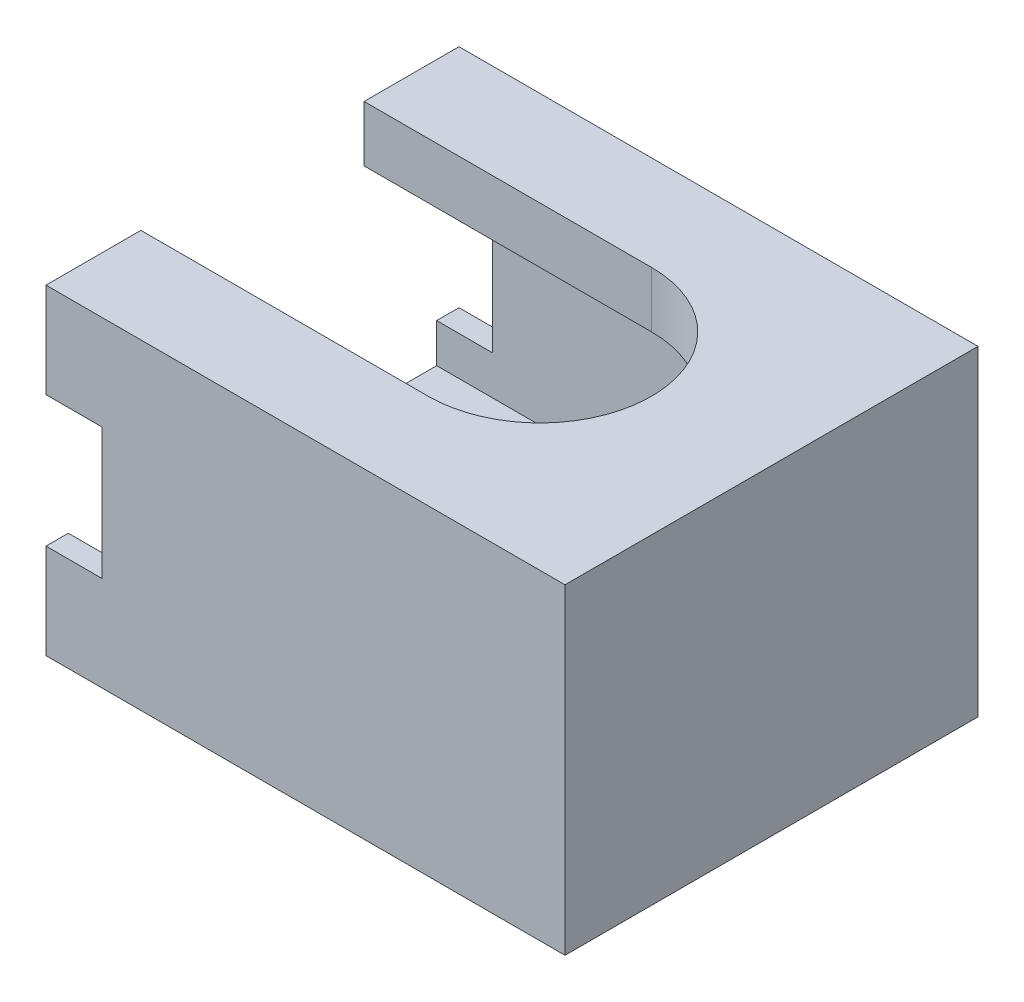
ISO-10303-21;
HEADER;
FILE_DESCRIPTION(('STEP AP214'),'2;1');
FILE_NAME('part.step','',(''),(''),'','','');
FILE_SCHEMA(('AUTOMOTIVE_DESIGN { 1 0 10303 214 1 1 1 1 }'));
ENDSEC;
DATA;
#1=APPLICATION_CONTEXT('core data for automotive mechanical design processes');
#2=APPLICATION_PROTOCOL_DEFINITION('international standard','automotive_design',2000,#1);
#3=PRODUCT_CONTEXT('',#1,'mechanical');
#4=PRODUCT('Part','Part','',(#3));
#5=PRODUCT_RELATED_PRODUCT_CATEGORY('part','',(#4));
#6=PRODUCT_DEFINITION_FORMATION('','',#4);
#7=PRODUCT_DEFINITION_CONTEXT('part definition',#1,'design');
#8=PRODUCT_DEFINITION('design','',#6,#7);
#9=PRODUCT_DEFINITION_SHAPE('','',#8);
#10=(LENGTH_UNIT() NAMED_UNIT(*) SI_UNIT(.MILLI.,.METRE.));
#11=(NAMED_UNIT(*) PLANE_ANGLE_UNIT() SI_UNIT($,.RADIAN.));
#12=(NAMED_UNIT(*) SI_UNIT($,.STERADIAN.) SOLID_ANGLE_UNIT());
#13=UNCERTAINTY_MEASURE_WITH_UNIT(LENGTH_MEASURE(1.E-05),#10,'distance_accuracy_value','');
#14=(GEOMETRIC_REPRESENTATION_CONTEXT(3) GLOBAL_UNCERTAINTY_ASSIGNED_CONTEXT((#13)) GLOBAL_UNIT_ASSIGNED_CONTEXT((#10,
#11,#12)) REPRESENTATION_CONTEXT('',''));
#15=CARTESIAN_POINT('',(0.,0.,0.));
#16=DIRECTION('',(0.,0.,1.));
#17=DIRECTION('',(1.,0.,0.));
#18=AXIS2_PLACEMENT_3D('',#15,#16,#17);
#19=CARTESIAN_POINT('',(-8.3,7.5,-7.4));
#20=DIRECTION('',(1.,0.,0.));
#21=DIRECTION('',(0.,0.,-1.));
#22=AXIS2_PLACEMENT_3D('',#19,#20,#21);
#23=PLANE('',#22);
#24=DIRECTION('',(0.,1.,0.));
#25=VECTOR('',#24,1.);
#26=CARTESIAN_POINT('',(-8.3,0.,-4.));
#27=LINE('',#26,#25);
#28=CARTESIAN_POINT('',(-8.3,-2.,-4.));
#29=VERTEX_POINT('',#28);
#30=CARTESIAN_POINT('',(-8.3,0.,-4.));
#31=VERTEX_POINT('',#30);
#32=EDGE_CURVE('E235',#29,#31,#27,.T.);
#33=ORIENTED_EDGE('',*,*,#32,.F.);
#34=DIRECTION('',(0.,0.,-1.));
#35=VECTOR('',#34,1.);
#36=CARTESIAN_POINT('',(-8.3,-2.,-7.4));
#37=LINE('',#36,#35);
#38=CARTESIAN_POINT('',(-8.3,-2.,4.));
#39=VERTEX_POINT('',#38);
#40=EDGE_CURVE('E216',#39,#29,#37,.T.);
#41=ORIENTED_EDGE('',*,*,#40,.F.);
#42=DIRECTION('',(0.,-1.,0.));
#43=VECTOR('',#42,1.);
#44=CARTESIAN_POINT('',(-8.3,-2.,4.));
#45=LINE('',#44,#43);
#46=CARTESIAN_POINT('',(-8.3,0.,4.));
#47=VERTEX_POINT('',#46);
#48=EDGE_CURVE('E263',#47,#39,#45,.T.);
#49=ORIENTED_EDGE('',*,*,#48,.F.);
#50=DIRECTION('',(0.,0.,-1.));
#51=VECTOR('',#50,1.);
#52=CARTESIAN_POINT('',(-8.3,0.,-7.4));
#53=LINE('',#52,#51);
#54=EDGE_CURVE('E404',#47,#31,#53,.T.);
#55=ORIENTED_EDGE('',*,*,#54,.T.);
#56=EDGE_LOOP('',(#33,#41,#49,#55));
#57=FACE_BOUND('',#56,.T.);
#58=ADVANCED_FACE('F39',(#57),#23,.F.);
#59=DIRECTION('',(0.,0.,-1.));
#60=VECTOR('',#59,1.);
#61=CARTESIAN_POINT('',(-8.3,1.4,-7.4));
#62=LINE('',#61,#60);
#63=CARTESIAN_POINT('',(-8.3,1.4,-6.6));
#64=VERTEX_POINT('',#63);
#65=CARTESIAN_POINT('',(-8.3,1.4,-7.4));
#66=VERTEX_POINT('',#65);
#67=EDGE_CURVE('E232',#64,#66,#62,.T.);
#68=ORIENTED_EDGE('',*,*,#67,.F.);
#69=DIRECTION('',(0.,-1.,0.));
#70=VECTOR('',#69,1.);
#71=CARTESIAN_POINT('',(-8.3,7.5,-6.6));
#72=LINE('',#71,#70);
#73=CARTESIAN_POINT('',(-8.3,6.1,-6.6));
#74=VERTEX_POINT('',#73);
#75=EDGE_CURVE('E428',#74,#64,#72,.T.);
#76=ORIENTED_EDGE('',*,*,#75,.F.);
#77=DIRECTION('',(0.,0.,1.));
#78=VECTOR('',#77,1.);
#79=CARTESIAN_POINT('',(-8.3,6.1,-7.4));
#80=LINE('',#79,#78);
#81=CARTESIAN_POINT('',(-8.3,6.1,-7.4));
#82=VERTEX_POINT('',#81);
#83=EDGE_CURVE('E333',#82,#74,#80,.T.);
#84=ORIENTED_EDGE('',*,*,#83,.F.);
#85=DIRECTION('',(0.,-1.,0.));
#86=VECTOR('',#85,1.);
#87=CARTESIAN_POINT('',(-8.3,7.5,-7.4));
#88=LINE('',#87,#86);
#89=EDGE_CURVE('E441',#82,#66,#88,.T.);
#90=ORIENTED_EDGE('',*,*,#89,.T.);
#91=EDGE_LOOP('',(#68,#76,#84,#90));
#92=FACE_BOUND('',#91,.T.);
#93=ADVANCED_FACE('F522',(#92),#23,.F.);
#94=DIRECTION('',(0.,0.,-1.));
#95=VECTOR('',#94,1.);
#96=CARTESIAN_POINT('',(-8.3,1.4,6.6));
#97=LINE('',#96,#95);
#98=CARTESIAN_POINT('',(-8.3,1.4,7.4));
#99=VERTEX_POINT('',#98);
#100=CARTESIAN_POINT('',(-8.3,1.4,6.6));
#101=VERTEX_POINT('',#100);
#102=EDGE_CURVE('E269',#99,#101,#97,.T.);
#103=ORIENTED_EDGE('',*,*,#102,.F.);
#104=DIRECTION('',(0.,-1.,0.));
#105=VECTOR('',#104,1.);
#106=CARTESIAN_POINT('',(-8.3,7.5,7.4));
#107=LINE('',#106,#105);
#108=CARTESIAN_POINT('',(-8.3,6.1,7.4));
#109=VERTEX_POINT('',#108);
#110=EDGE_CURVE('E450',#109,#99,#107,.T.);
#111=ORIENTED_EDGE('',*,*,#110,.F.);
#112=DIRECTION('',(0.,0.,1.));
#113=VECTOR('',#112,1.);
#114=CARTESIAN_POINT('',(-8.3,6.1,6.6));
#115=LINE('',#114,#113);
#116=CARTESIAN_POINT('',(-8.3,6.1,6.6));
#117=VERTEX_POINT('',#116);
#118=EDGE_CURVE('E63',#117,#109,#115,.T.);
#119=ORIENTED_EDGE('',*,*,#118,.F.);
#120=DIRECTION('',(0.,-1.,0.));
#121=VECTOR('',#120,1.);
#122=CARTESIAN_POINT('',(-8.3,7.5,6.6));
#123=LINE('',#122,#121);
#124=EDGE_CURVE('E454',#117,#101,#123,.T.);
#125=ORIENTED_EDGE('',*,*,#124,.T.);
#126=EDGE_LOOP('',(#103,#111,#119,#125));
#127=FACE_BOUND('',#126,.T.);
#128=ADVANCED_FACE('F491',(#127),#23,.F.);
#129=CARTESIAN_POINT('',(7.5,7.5,-6.6));
#130=DIRECTION('',(0.,0.,-1.));
#131=DIRECTION('',(-1.,0.,0.));
#132=AXIS2_PLACEMENT_3D('',#129,#130,#131);
#133=PLANE('',#132);
#134=DIRECTION('',(1.,0.,0.));
#135=VECTOR('',#134,1.);
#136=CARTESIAN_POINT('',(7.5,0.,-6.6));
#137=LINE('',#136,#135);
#138=CARTESIAN_POINT('',(-10.3,0.,-6.6));
#139=VERTEX_POINT('',#138);
#140=CARTESIAN_POINT('',(7.5,0.,-6.6));
#141=VERTEX_POINT('',#140);
#142=EDGE_CURVE('E215',#139,#141,#137,.T.);
#143=ORIENTED_EDGE('',*,*,#142,.T.);
#144=DIRECTION('',(0.,-1.,0.));
#145=VECTOR('',#144,1.);
#146=CARTESIAN_POINT('',(7.5,7.5,-6.6));
#147=LINE('',#146,#145);
#148=CARTESIAN_POINT('',(7.5,7.5,-6.6));
#149=VERTEX_POINT('',#148);
#150=EDGE_CURVE('E11',#149,#141,#147,.T.);
#151=ORIENTED_EDGE('',*,*,#150,.F.);
#152=DIRECTION('',(1.,0.,0.));
#153=VECTOR('',#152,1.);
#154=CARTESIAN_POINT('',(-8.3,7.5,-6.6));
#155=LINE('',#154,#153);
#156=CARTESIAN_POINT('',(-10.3,7.5,-6.6));
#157=VERTEX_POINT('',#156);
#158=EDGE_CURVE('E416',#157,#149,#155,.T.);
#159=ORIENTED_EDGE('',*,*,#158,.F.);
#160=DIRECTION('',(0.,1.,0.));
#161=VECTOR('',#160,1.);
#162=CARTESIAN_POINT('',(-10.3,6.1,-6.6));
#163=LINE('',#162,#161);
#164=CARTESIAN_POINT('',(-10.3,6.1,-6.6));
#165=VERTEX_POINT('',#164);
#166=EDGE_CURVE('E348',#165,#157,#163,.T.);
#167=ORIENTED_EDGE('',*,*,#166,.F.);
#168=DIRECTION('',(1.,0.,0.));
#169=VECTOR('',#168,1.);
#170=CARTESIAN_POINT('',(-10.3,6.1,-6.6));
#171=LINE('',#170,#169);
#172=EDGE_CURVE('E356',#165,#74,#171,.T.);
#173=ORIENTED_EDGE('',*,*,#172,.T.);
#174=ORIENTED_EDGE('',*,*,#75,.T.);
#175=DIRECTION('',(1.,0.,0.));
#176=VECTOR('',#175,1.);
#177=CARTESIAN_POINT('',(-10.3,1.4,-6.6));
#178=LINE('',#177,#176);
#179=CARTESIAN_POINT('',(-10.3,1.4,-6.6));
#180=VERTEX_POINT('',#179);
#181=EDGE_CURVE('E254',#180,#64,#178,.T.);
#182=ORIENTED_EDGE('',*,*,#181,.F.);
#183=DIRECTION('',(0.,1.,0.));
#184=VECTOR('',#183,1.);
#185=CARTESIAN_POINT('',(-10.3,1.4,-6.6));
#186=LINE('',#185,#184);
#187=EDGE_CURVE('E244',#139,#180,#186,.T.);
#188=ORIENTED_EDGE('',*,*,#187,.F.);
#189=EDGE_LOOP('',(#143,#151,#159,#167,#173,#174,#182,#188));
#190=FACE_BOUND('',#189,.T.);
#191=ADVANCED_FACE('F41',(#190),#133,.F.);
#192=CARTESIAN_POINT('',(7.5,7.5,6.6));
#193=DIRECTION('',(1.,0.,0.));
#194=DIRECTION('',(0.,0.,-1.));
#195=AXIS2_PLACEMENT_3D('',#192,#193,#194);
#196=PLANE('',#195);
#197=DIRECTION('',(0.,0.,1.));
#198=VECTOR('',#197,1.);
#199=CARTESIAN_POINT('',(7.5,0.,6.6));
#200=LINE('',#199,#198);
#201=CARTESIAN_POINT('',(7.5,0.,6.6));
#202=VERTEX_POINT('',#201);
#203=EDGE_CURVE('E432',#141,#202,#200,.T.);
#204=ORIENTED_EDGE('',*,*,#203,.T.);
#205=DIRECTION('',(0.,-1.,0.));
#206=VECTOR('',#205,1.);
#207=CARTESIAN_POINT('',(7.5,7.5,6.6));
#208=LINE('',#207,#206);
#209=CARTESIAN_POINT('',(7.5,7.5,6.6));
#210=VERTEX_POINT('',#209);
#211=EDGE_CURVE('E48',#210,#202,#208,.T.);
#212=ORIENTED_EDGE('',*,*,#211,.F.);
#213=DIRECTION('',(0.,0.,1.));
#214=VECTOR('',#213,1.);
#215=CARTESIAN_POINT('',(7.5,7.5,6.6));
#216=LINE('',#215,#214);
#217=EDGE_CURVE('E420',#149,#210,#216,.T.);
#218=ORIENTED_EDGE('',*,*,#217,.F.);
#219=ORIENTED_EDGE('',*,*,#150,.T.);
#220=EDGE_LOOP('',(#204,#212,#218,#219));
#221=FACE_BOUND('',#220,.T.);
#222=ADVANCED_FACE('F466',(#221),#196,.F.);
#223=CARTESIAN_POINT('',(-7.5,7.5,6.6));
#224=DIRECTION('',(0.,0.,1.));
#225=DIRECTION('',(1.,0.,0.));
#226=AXIS2_PLACEMENT_3D('',#223,#224,#225);
#227=PLANE('',#226);
#228=DIRECTION('',(-1.,0.,0.));
#229=VECTOR('',#228,1.);
#230=CARTESIAN_POINT('',(-7.5,0.,6.6));
#231=LINE('',#230,#229);
#232=CARTESIAN_POINT('',(-10.3,0.,6.6));
#233=VERTEX_POINT('',#232);
#234=EDGE_CURVE('E421',#202,#233,#231,.T.);
#235=ORIENTED_EDGE('',*,*,#234,.T.);
#236=DIRECTION('',(0.,-1.,0.));
#237=VECTOR('',#236,1.);
#238=CARTESIAN_POINT('',(-10.3,0.,6.6));
#239=LINE('',#238,#237);
#240=CARTESIAN_POINT('',(-10.3,1.4,6.6));
#241=VERTEX_POINT('',#240);
#242=EDGE_CURVE('E264',#241,#233,#239,.T.);
#243=ORIENTED_EDGE('',*,*,#242,.F.);
#244=DIRECTION('',(1.,0.,0.));
#245=VECTOR('',#244,1.);
#246=CARTESIAN_POINT('',(-10.3,1.4,6.6));
#247=LINE('',#246,#245);
#248=EDGE_CURVE('E285',#241,#101,#247,.T.);
#249=ORIENTED_EDGE('',*,*,#248,.T.);
#250=ORIENTED_EDGE('',*,*,#124,.F.);
#251=DIRECTION('',(1.,0.,0.));
#252=VECTOR('',#251,1.);
#253=CARTESIAN_POINT('',(-10.3,6.1,6.6));
#254=LINE('',#253,#252);
#255=CARTESIAN_POINT('',(-10.3,6.1,6.6));
#256=VERTEX_POINT('',#255);
#257=EDGE_CURVE('E329',#256,#117,#254,.T.);
#258=ORIENTED_EDGE('',*,*,#257,.F.);
#259=DIRECTION('',(0.,-1.,0.));
#260=VECTOR('',#259,1.);
#261=CARTESIAN_POINT('',(-10.3,7.5,6.6));
#262=LINE('',#261,#260);
#263=CARTESIAN_POINT('',(-10.3,7.5,6.6));
#264=VERTEX_POINT('',#263);
#265=EDGE_CURVE('E313',#264,#256,#262,.T.);
#266=ORIENTED_EDGE('',*,*,#265,.F.);
#267=DIRECTION('',(-1.,0.,0.));
#268=VECTOR('',#267,1.);
#269=CARTESIAN_POINT('',(7.5,7.5,6.6));
#270=LINE('',#269,#268);
#271=EDGE_CURVE('E425',#210,#264,#270,.T.);
#272=ORIENTED_EDGE('',*,*,#271,.F.);
#273=ORIENTED_EDGE('',*,*,#211,.T.);
#274=EDGE_LOOP('',(#235,#243,#249,#250,#258,#266,#272,#273));
#275=FACE_BOUND('',#274,.T.);
#276=ADVANCED_FACE('F460',(#275),#227,.F.);
#277=CARTESIAN_POINT('',(8.3,7.5,7.4));
#278=DIRECTION('',(0.,0.,-1.));
#279=DIRECTION('',(-1.,0.,0.));
#280=AXIS2_PLACEMENT_3D('',#277,#278,#279);
#281=PLANE('',#280);
#282=DIRECTION('',(1.,0.,0.));
#283=VECTOR('',#282,1.);
#284=CARTESIAN_POINT('',(8.3,9.5,7.4));
#285=LINE('',#284,#283);
#286=CARTESIAN_POINT('',(-10.3,9.5,7.4));
#287=VERTEX_POINT('',#286);
#288=CARTESIAN_POINT('',(8.3,9.5,7.4));
#289=VERTEX_POINT('',#288);
#290=EDGE_CURVE('E378',#287,#289,#285,.T.);
#291=ORIENTED_EDGE('',*,*,#290,.F.);
#292=DIRECTION('',(0.,1.,0.));
#293=VECTOR('',#292,1.);
#294=CARTESIAN_POINT('',(-10.3,6.1,7.4));
#295=LINE('',#294,#293);
#296=CARTESIAN_POINT('',(-10.3,6.1,7.4));
#297=VERTEX_POINT('',#296);
#298=EDGE_CURVE('E319',#297,#287,#295,.T.);
#299=ORIENTED_EDGE('',*,*,#298,.F.);
#300=DIRECTION('',(1.,0.,0.));
#301=VECTOR('',#300,1.);
#302=CARTESIAN_POINT('',(-10.3,6.1,7.4));
#303=LINE('',#302,#301);
#304=EDGE_CURVE('E323',#297,#109,#303,.T.);
#305=ORIENTED_EDGE('',*,*,#304,.T.);
#306=ORIENTED_EDGE('',*,*,#110,.T.);
#307=DIRECTION('',(1.,0.,0.));
#308=VECTOR('',#307,1.);
#309=CARTESIAN_POINT('',(-10.3,1.4,7.4));
#310=LINE('',#309,#308);
#311=CARTESIAN_POINT('',(-10.3,1.4,7.4));
#312=VERTEX_POINT('',#311);
#313=EDGE_CURVE('E293',#312,#99,#310,.T.);
#314=ORIENTED_EDGE('',*,*,#313,.F.);
#315=DIRECTION('',(0.,1.,0.));
#316=VECTOR('',#315,1.);
#317=CARTESIAN_POINT('',(-10.3,1.4,7.4));
#318=LINE('',#317,#316);
#319=CARTESIAN_POINT('',(-10.3,-2.,7.4));
#320=VERTEX_POINT('',#319);
#321=EDGE_CURVE('E279',#320,#312,#318,.T.);
#322=ORIENTED_EDGE('',*,*,#321,.F.);
#323=DIRECTION('',(-1.,0.,0.));
#324=VECTOR('',#323,1.);
#325=CARTESIAN_POINT('',(-8.3,-2.,7.4));
#326=LINE('',#325,#324);
#327=CARTESIAN_POINT('',(8.3,-2.,7.4));
#328=VERTEX_POINT('',#327);
#329=EDGE_CURVE('E408',#328,#320,#326,.T.);
#330=ORIENTED_EDGE('',*,*,#329,.F.);
#331=DIRECTION('',(0.,-1.,0.));
#332=VECTOR('',#331,1.);
#333=CARTESIAN_POINT('',(8.3,7.5,7.4));
#334=LINE('',#333,#332);
#335=EDGE_CURVE('E447',#289,#328,#334,.T.);
#336=ORIENTED_EDGE('',*,*,#335,.F.);
#337=EDGE_LOOP('',(#291,#299,#305,#306,#314,#322,#330,#336));
#338=FACE_BOUND('',#337,.T.);
#339=ADVANCED_FACE('F494',(#338),#281,.F.);
#340=CARTESIAN_POINT('',(8.3,7.5,7.4));
#341=DIRECTION('',(-1.,0.,0.));
#342=DIRECTION('',(0.,0.,1.));
#343=AXIS2_PLACEMENT_3D('',#340,#341,#342);
#344=PLANE('',#343);
#345=ORIENTED_EDGE('',*,*,#335,.T.);
#346=DIRECTION('',(0.,0.,1.));
#347=VECTOR('',#346,1.);
#348=CARTESIAN_POINT('',(8.3,-2.,-7.4));
#349=LINE('',#348,#347);
#350=CARTESIAN_POINT('',(8.3,-2.,-7.4));
#351=VERTEX_POINT('',#350);
#352=EDGE_CURVE('E405',#351,#328,#349,.T.);
#353=ORIENTED_EDGE('',*,*,#352,.F.);
#354=DIRECTION('',(0.,-1.,0.));
#355=VECTOR('',#354,1.);
#356=CARTESIAN_POINT('',(8.3,7.5,-7.4));
#357=LINE('',#356,#355);
#358=CARTESIAN_POINT('',(8.3,9.5,-7.4));
#359=VERTEX_POINT('',#358);
#360=EDGE_CURVE('E211',#359,#351,#357,.T.);
#361=ORIENTED_EDGE('',*,*,#360,.F.);
#362=DIRECTION('',(0.,0.,-1.));
#363=VECTOR('',#362,1.);
#364=CARTESIAN_POINT('',(8.3,9.5,7.4));
#365=LINE('',#364,#363);
#366=EDGE_CURVE('E382',#289,#359,#365,.T.);
#367=ORIENTED_EDGE('',*,*,#366,.F.);
#368=EDGE_LOOP('',(#345,#353,#361,#367));
#369=FACE_BOUND('',#368,.T.);
#370=ADVANCED_FACE('F542',(#369),#344,.F.);
#371=CARTESIAN_POINT('',(8.3,7.5,-7.4));
#372=DIRECTION('',(0.,0.,1.));
#373=DIRECTION('',(1.,0.,0.));
#374=AXIS2_PLACEMENT_3D('',#371,#372,#373);
#375=PLANE('',#374);
#376=ORIENTED_EDGE('',*,*,#360,.T.);
#377=DIRECTION('',(1.,0.,0.));
#378=VECTOR('',#377,1.);
#379=CARTESIAN_POINT('',(-8.3,-2.,-7.4));
#380=LINE('',#379,#378);
#381=CARTESIAN_POINT('',(-10.3,-2.,-7.4));
#382=VERTEX_POINT('',#381);
#383=EDGE_CURVE('E204',#382,#351,#380,.T.);
#384=ORIENTED_EDGE('',*,*,#383,.F.);
#385=DIRECTION('',(0.,-1.,0.));
#386=VECTOR('',#385,1.);
#387=CARTESIAN_POINT('',(-10.3,-2.,-7.4));
#388=LINE('',#387,#386);
#389=CARTESIAN_POINT('',(-10.3,1.4,-7.4));
#390=VERTEX_POINT('',#389);
#391=EDGE_CURVE('E209',#390,#382,#388,.T.);
#392=ORIENTED_EDGE('',*,*,#391,.F.);
#393=DIRECTION('',(1.,0.,0.));
#394=VECTOR('',#393,1.);
#395=CARTESIAN_POINT('',(-10.3,1.4,-7.4));
#396=LINE('',#395,#394);
#397=EDGE_CURVE('E249',#390,#66,#396,.T.);
#398=ORIENTED_EDGE('',*,*,#397,.T.);
#399=ORIENTED_EDGE('',*,*,#89,.F.);
#400=DIRECTION('',(1.,0.,0.));
#401=VECTOR('',#400,1.);
#402=CARTESIAN_POINT('',(-10.3,6.1,-7.4));
#403=LINE('',#402,#401);
#404=CARTESIAN_POINT('',(-10.3,6.1,-7.4));
#405=VERTEX_POINT('',#404);
#406=EDGE_CURVE('E363',#405,#82,#403,.T.);
#407=ORIENTED_EDGE('',*,*,#406,.F.);
#408=DIRECTION('',(0.,-1.,0.));
#409=VECTOR('',#408,1.);
#410=CARTESIAN_POINT('',(-10.3,9.5,-7.4));
#411=LINE('',#410,#409);
#412=CARTESIAN_POINT('',(-10.3,9.5,-7.4));
#413=VERTEX_POINT('',#412);
#414=EDGE_CURVE('E342',#413,#405,#411,.T.);
#415=ORIENTED_EDGE('',*,*,#414,.F.);
#416=DIRECTION('',(-1.,0.,0.));
#417=VECTOR('',#416,1.);
#418=CARTESIAN_POINT('',(8.3,9.5,-7.4));
#419=LINE('',#418,#417);
#420=EDGE_CURVE('E386',#359,#413,#419,.T.);
#421=ORIENTED_EDGE('',*,*,#420,.F.);
#422=EDGE_LOOP('',(#376,#384,#392,#398,#399,#407,#415,#421));
#423=FACE_BOUND('',#422,.T.);
#424=ADVANCED_FACE('F206',(#423),#375,.F.);
#425=CARTESIAN_POINT('',(0.,0.,0.));
#426=DIRECTION('',(0.,1.,0.));
#427=DIRECTION('',(0.,0.,1.));
#428=AXIS2_PLACEMENT_3D('',#425,#426,#427);
#429=PLANE('',#428);
#430=ORIENTED_EDGE('',*,*,#142,.F.);
#431=DIRECTION('',(0.,0.,-1.));
#432=VECTOR('',#431,1.);
#433=CARTESIAN_POINT('',(-10.3,0.,-6.6));
#434=LINE('',#433,#432);
#435=CARTESIAN_POINT('',(-10.3,0.,-4.));
#436=VERTEX_POINT('',#435);
#437=EDGE_CURVE('E240',#436,#139,#434,.T.);
#438=ORIENTED_EDGE('',*,*,#437,.F.);
#439=DIRECTION('',(1.,0.,0.));
#440=VECTOR('',#439,1.);
#441=CARTESIAN_POINT('',(-10.3,0.,-4.));
#442=LINE('',#441,#440);
#443=EDGE_CURVE('E257',#436,#31,#442,.T.);
#444=ORIENTED_EDGE('',*,*,#443,.T.);
#445=ORIENTED_EDGE('',*,*,#54,.F.);
#446=DIRECTION('',(1.,0.,0.));
#447=VECTOR('',#446,1.);
#448=CARTESIAN_POINT('',(-10.3,0.,4.));
#449=LINE('',#448,#447);
#450=CARTESIAN_POINT('',(-10.3,0.,4.));
#451=VERTEX_POINT('',#450);
#452=EDGE_CURVE('E298',#451,#47,#449,.T.);
#453=ORIENTED_EDGE('',*,*,#452,.F.);
#454=DIRECTION('',(0.,0.,-1.));
#455=VECTOR('',#454,1.);
#456=CARTESIAN_POINT('',(-10.3,0.,4.));
#457=LINE('',#456,#455);
#458=EDGE_CURVE('E268',#233,#451,#457,.T.);
#459=ORIENTED_EDGE('',*,*,#458,.F.);
#460=ORIENTED_EDGE('',*,*,#234,.F.);
#461=ORIENTED_EDGE('',*,*,#203,.F.);
#462=EDGE_LOOP('',(#430,#438,#444,#445,#453,#459,#460,#461));
#463=FACE_BOUND('',#462,.T.);
#464=ADVANCED_FACE('F468',(#463),#429,.T.);
#465=CARTESIAN_POINT('',(0.,-2.,0.));
#466=DIRECTION('',(0.,1.,0.));
#467=DIRECTION('',(0.,0.,1.));
#468=AXIS2_PLACEMENT_3D('',#465,#466,#467);
#469=PLANE('',#468);
#470=ORIENTED_EDGE('',*,*,#352,.T.);
#471=ORIENTED_EDGE('',*,*,#329,.T.);
#472=DIRECTION('',(0.,0.,1.));
#473=VECTOR('',#472,1.);
#474=CARTESIAN_POINT('',(-10.3,-2.,7.4));
#475=LINE('',#474,#473);
#476=CARTESIAN_POINT('',(-10.3,-2.,4.));
#477=VERTEX_POINT('',#476);
#478=EDGE_CURVE('E275',#477,#320,#475,.T.);
#479=ORIENTED_EDGE('',*,*,#478,.F.);
#480=DIRECTION('',(1.,0.,0.));
#481=VECTOR('',#480,1.);
#482=CARTESIAN_POINT('',(-10.3,-2.,4.));
#483=LINE('',#482,#481);
#484=EDGE_CURVE('E55',#477,#39,#483,.T.);
#485=ORIENTED_EDGE('',*,*,#484,.T.);
#486=ORIENTED_EDGE('',*,*,#40,.T.);
#487=DIRECTION('',(1.,0.,0.));
#488=VECTOR('',#487,1.);
#489=CARTESIAN_POINT('',(-10.3,-2.,-4.));
#490=LINE('',#489,#488);
#491=CARTESIAN_POINT('',(-10.3,-2.,-4.));
#492=VERTEX_POINT('',#491);
#493=EDGE_CURVE('E221',#492,#29,#490,.T.);
#494=ORIENTED_EDGE('',*,*,#493,.F.);
#495=DIRECTION('',(0.,0.,1.));
#496=VECTOR('',#495,1.);
#497=CARTESIAN_POINT('',(-10.3,-2.,-4.));
#498=LINE('',#497,#496);
#499=EDGE_CURVE('E219',#382,#492,#498,.T.);
#500=ORIENTED_EDGE('',*,*,#499,.F.);
#501=ORIENTED_EDGE('',*,*,#383,.T.);
#502=EDGE_LOOP('',(#470,#471,#479,#485,#486,#494,#500,#501));
#503=FACE_BOUND('',#502,.T.);
#504=ADVANCED_FACE('F220',(#503),#469,.F.);
#505=CARTESIAN_POINT('',(-8.3,9.5,-4.));
#506=DIRECTION('',(0.,0.,-1.));
#507=DIRECTION('',(-1.,0.,0.));
#508=AXIS2_PLACEMENT_3D('',#505,#506,#507);
#509=PLANE('',#508);
#510=DIRECTION('',(1.,0.,0.));
#511=VECTOR('',#510,1.);
#512=CARTESIAN_POINT('',(-8.3,7.5,-4.));
#513=LINE('',#512,#511);
#514=CARTESIAN_POINT('',(-10.3,7.5,-4.));
#515=VERTEX_POINT('',#514);
#516=CARTESIAN_POINT('',(0.,7.5,-4.));
#517=VERTEX_POINT('',#516);
#518=EDGE_CURVE('E367',#515,#517,#513,.T.);
#519=ORIENTED_EDGE('',*,*,#518,.T.);
#520=DIRECTION('',(0.,-1.,0.));
#521=VECTOR('',#520,1.);
#522=CARTESIAN_POINT('',(0.,9.5,-4.));
#523=LINE('',#522,#521);
#524=CARTESIAN_POINT('',(0.,9.5,-4.));
#525=VERTEX_POINT('',#524);
#526=EDGE_CURVE('E400',#525,#517,#523,.T.);
#527=ORIENTED_EDGE('',*,*,#526,.F.);
#528=DIRECTION('',(1.,0.,0.));
#529=VECTOR('',#528,1.);
#530=CARTESIAN_POINT('',(-8.3,9.5,-4.));
#531=LINE('',#530,#529);
#532=CARTESIAN_POINT('',(-10.3,9.5,-4.));
#533=VERTEX_POINT('',#532);
#534=EDGE_CURVE('E368',#533,#525,#531,.T.);
#535=ORIENTED_EDGE('',*,*,#534,.F.);
#536=DIRECTION('',(0.,1.,0.));
#537=VECTOR('',#536,1.);
#538=CARTESIAN_POINT('',(-10.3,7.5,-4.));
#539=LINE('',#538,#537);
#540=EDGE_CURVE('E334',#515,#533,#539,.T.);
#541=ORIENTED_EDGE('',*,*,#540,.F.);
#542=EDGE_LOOP('',(#519,#527,#535,#541));
#543=FACE_BOUND('',#542,.T.);
#544=ADVANCED_FACE('F531',(#543),#509,.F.);
#545=CARTESIAN_POINT('',(0.,9.5,0.));
#546=DIRECTION('',(0.,-1.,0.));
#547=DIRECTION('',(0.,0.,-1.));
#548=AXIS2_PLACEMENT_3D('',#545,#546,#547);
#549=CYLINDRICAL_SURFACE('',#548,4.);
#550=CARTESIAN_POINT('',(0.,7.5,0.));
#551=DIRECTION('',(0.,-1.,0.));
#552=DIRECTION('',(0.,0.,-1.));
#553=AXIS2_PLACEMENT_3D('',#550,#551,#552);
#554=CIRCLE('',#553,4.);
#555=CARTESIAN_POINT('',(0.,7.5,4.));
#556=VERTEX_POINT('',#555);
#557=EDGE_CURVE('E392',#517,#556,#554,.T.);
#558=ORIENTED_EDGE('',*,*,#557,.T.);
#559=DIRECTION('',(0.,-1.,0.));
#560=VECTOR('',#559,1.);
#561=CARTESIAN_POINT('',(0.,9.5,4.));
#562=LINE('',#561,#560);
#563=CARTESIAN_POINT('',(0.,9.5,4.));
#564=VERTEX_POINT('',#563);
#565=EDGE_CURVE('E389',#564,#556,#562,.T.);
#566=ORIENTED_EDGE('',*,*,#565,.F.);
#567=CARTESIAN_POINT('',(0.,9.5,0.));
#568=DIRECTION('',(0.,-1.,0.));
#569=DIRECTION('',(0.,0.,-1.));
#570=AXIS2_PLACEMENT_3D('',#567,#568,#569);
#571=CIRCLE('',#570,4.);
#572=EDGE_CURVE('E371',#525,#564,#571,.T.);
#573=ORIENTED_EDGE('',*,*,#572,.F.);
#574=ORIENTED_EDGE('',*,*,#526,.T.);
#575=EDGE_LOOP('',(#558,#566,#573,#574));
#576=FACE_BOUND('',#575,.T.);
#577=ADVANCED_FACE('F538',(#576),#549,.F.);
#578=CARTESIAN_POINT('',(-8.3,9.5,4.));
#579=DIRECTION('',(0.,0.,1.));
#580=DIRECTION('',(1.,0.,0.));
#581=AXIS2_PLACEMENT_3D('',#578,#579,#580);
#582=PLANE('',#581);
#583=DIRECTION('',(-1.,0.,0.));
#584=VECTOR('',#583,1.);
#585=CARTESIAN_POINT('',(-8.3,7.5,4.));
#586=LINE('',#585,#584);
#587=CARTESIAN_POINT('',(-10.3,7.5,4.));
#588=VERTEX_POINT('',#587);
#589=EDGE_CURVE('E372',#556,#588,#586,.T.);
#590=ORIENTED_EDGE('',*,*,#589,.T.);
#591=DIRECTION('',(0.,-1.,0.));
#592=VECTOR('',#591,1.);
#593=CARTESIAN_POINT('',(-10.3,9.5,4.));
#594=LINE('',#593,#592);
#595=CARTESIAN_POINT('',(-10.3,9.5,4.));
#596=VERTEX_POINT('',#595);
#597=EDGE_CURVE('E305',#596,#588,#594,.T.);
#598=ORIENTED_EDGE('',*,*,#597,.F.);
#599=DIRECTION('',(-1.,0.,0.));
#600=VECTOR('',#599,1.);
#601=CARTESIAN_POINT('',(-8.3,9.5,4.));
#602=LINE('',#601,#600);
#603=EDGE_CURVE('E375',#564,#596,#602,.T.);
#604=ORIENTED_EDGE('',*,*,#603,.F.);
#605=ORIENTED_EDGE('',*,*,#565,.T.);
#606=EDGE_LOOP('',(#590,#598,#604,#605));
#607=FACE_BOUND('',#606,.T.);
#608=ADVANCED_FACE('F540',(#607),#582,.F.);
#609=CARTESIAN_POINT('',(0.,9.5,0.));
#610=DIRECTION('',(0.,-1.,0.));
#611=DIRECTION('',(0.,0.,-1.));
#612=AXIS2_PLACEMENT_3D('',#609,#610,#611);
#613=PLANE('',#612);
#614=ORIENTED_EDGE('',*,*,#420,.T.);
#615=DIRECTION('',(0.,0.,-1.));
#616=VECTOR('',#615,1.);
#617=CARTESIAN_POINT('',(-10.3,9.5,-4.));
#618=LINE('',#617,#616);
#619=EDGE_CURVE('E338',#533,#413,#618,.T.);
#620=ORIENTED_EDGE('',*,*,#619,.F.);
#621=ORIENTED_EDGE('',*,*,#534,.T.);
#622=ORIENTED_EDGE('',*,*,#572,.T.);
#623=ORIENTED_EDGE('',*,*,#603,.T.);
#624=DIRECTION('',(0.,0.,-1.));
#625=VECTOR('',#624,1.);
#626=CARTESIAN_POINT('',(-10.3,9.5,7.4));
#627=LINE('',#626,#625);
#628=EDGE_CURVE('E301',#287,#596,#627,.T.);
#629=ORIENTED_EDGE('',*,*,#628,.F.);
#630=ORIENTED_EDGE('',*,*,#290,.T.);
#631=ORIENTED_EDGE('',*,*,#366,.T.);
#632=EDGE_LOOP('',(#614,#620,#621,#622,#623,#629,#630,#631));
#633=FACE_BOUND('',#632,.T.);
#634=ADVANCED_FACE('F528',(#633),#613,.F.);
#635=CARTESIAN_POINT('',(0.,7.5,0.));
#636=DIRECTION('',(0.,-1.,0.));
#637=DIRECTION('',(0.,0.,-1.));
#638=AXIS2_PLACEMENT_3D('',#635,#636,#637);
#639=PLANE('',#638);
#640=ORIENTED_EDGE('',*,*,#518,.F.);
#641=DIRECTION('',(0.,0.,1.));
#642=VECTOR('',#641,1.);
#643=CARTESIAN_POINT('',(-10.3,7.5,-6.6));
#644=LINE('',#643,#642);
#645=EDGE_CURVE('E352',#157,#515,#644,.T.);
#646=ORIENTED_EDGE('',*,*,#645,.F.);
#647=ORIENTED_EDGE('',*,*,#158,.T.);
#648=ORIENTED_EDGE('',*,*,#217,.T.);
#649=ORIENTED_EDGE('',*,*,#271,.T.);
#650=DIRECTION('',(0.,0.,1.));
#651=VECTOR('',#650,1.);
#652=CARTESIAN_POINT('',(-10.3,7.5,4.));
#653=LINE('',#652,#651);
#654=EDGE_CURVE('E309',#588,#264,#653,.T.);
#655=ORIENTED_EDGE('',*,*,#654,.F.);
#656=ORIENTED_EDGE('',*,*,#589,.F.);
#657=ORIENTED_EDGE('',*,*,#557,.F.);
#658=EDGE_LOOP('',(#640,#646,#647,#648,#649,#655,#656,#657));
#659=FACE_BOUND('',#658,.T.);
#660=ADVANCED_FACE('F507',(#659),#639,.T.);
#661=CARTESIAN_POINT('',(-10.3,6.1,-7.4));
#662=DIRECTION('',(0.,1.,0.));
#663=DIRECTION('',(0.,0.,1.));
#664=AXIS2_PLACEMENT_3D('',#661,#662,#663);
#665=PLANE('',#664);
#666=ORIENTED_EDGE('',*,*,#83,.T.);
#667=ORIENTED_EDGE('',*,*,#172,.F.);
#668=DIRECTION('',(0.,0.,1.));
#669=VECTOR('',#668,1.);
#670=CARTESIAN_POINT('',(-10.3,6.1,-7.4));
#671=LINE('',#670,#669);
#672=EDGE_CURVE('E345',#405,#165,#671,.T.);
#673=ORIENTED_EDGE('',*,*,#672,.F.);
#674=ORIENTED_EDGE('',*,*,#406,.T.);
#675=EDGE_LOOP('',(#666,#667,#673,#674));
#676=FACE_BOUND('',#675,.T.);
#677=ADVANCED_FACE('F519',(#676),#665,.F.);
#678=CARTESIAN_POINT('',(-10.3,0.,0.));
#679=DIRECTION('',(-1.,0.,0.));
#680=DIRECTION('',(0.,0.,1.));
#681=AXIS2_PLACEMENT_3D('',#678,#679,#680);
#682=PLANE('',#681);
#683=ORIENTED_EDGE('',*,*,#540,.T.);
#684=ORIENTED_EDGE('',*,*,#619,.T.);
#685=ORIENTED_EDGE('',*,*,#414,.T.);
#686=ORIENTED_EDGE('',*,*,#672,.T.);
#687=ORIENTED_EDGE('',*,*,#166,.T.);
#688=ORIENTED_EDGE('',*,*,#645,.T.);
#689=EDGE_LOOP('',(#683,#684,#685,#686,#687,#688));
#690=FACE_BOUND('',#689,.T.);
#691=ADVANCED_FACE('F512',(#690),#682,.T.);
#692=CARTESIAN_POINT('',(-10.3,6.1,6.6));
#693=DIRECTION('',(0.,1.,0.));
#694=DIRECTION('',(0.,0.,1.));
#695=AXIS2_PLACEMENT_3D('',#692,#693,#694);
#696=PLANE('',#695);
#697=ORIENTED_EDGE('',*,*,#118,.T.);
#698=ORIENTED_EDGE('',*,*,#304,.F.);
#699=DIRECTION('',(0.,0.,1.));
#700=VECTOR('',#699,1.);
#701=CARTESIAN_POINT('',(-10.3,6.1,6.6));
#702=LINE('',#701,#700);
#703=EDGE_CURVE('E316',#256,#297,#702,.T.);
#704=ORIENTED_EDGE('',*,*,#703,.F.);
#705=ORIENTED_EDGE('',*,*,#257,.T.);
#706=EDGE_LOOP('',(#697,#698,#704,#705));
#707=FACE_BOUND('',#706,.T.);
#708=ADVANCED_FACE('F500',(#707),#696,.F.);
#709=CARTESIAN_POINT('',(-10.3,0.,0.));
#710=DIRECTION('',(-1.,0.,0.));
#711=DIRECTION('',(0.,0.,1.));
#712=AXIS2_PLACEMENT_3D('',#709,#710,#711);
#713=PLANE('',#712);
#714=ORIENTED_EDGE('',*,*,#628,.T.);
#715=ORIENTED_EDGE('',*,*,#597,.T.);
#716=ORIENTED_EDGE('',*,*,#654,.T.);
#717=ORIENTED_EDGE('',*,*,#265,.T.);
#718=ORIENTED_EDGE('',*,*,#703,.T.);
#719=ORIENTED_EDGE('',*,*,#298,.T.);
#720=EDGE_LOOP('',(#714,#715,#716,#717,#718,#719));
#721=FACE_BOUND('',#720,.T.);
#722=ADVANCED_FACE('F502',(#721),#713,.T.);
#723=CARTESIAN_POINT('',(-10.3,-2.,4.));
#724=DIRECTION('',(0.,0.,1.));
#725=DIRECTION('',(0.,-1.,0.));
#726=AXIS2_PLACEMENT_3D('',#723,#724,#725);
#727=PLANE('',#726);
#728=ORIENTED_EDGE('',*,*,#48,.T.);
#729=ORIENTED_EDGE('',*,*,#484,.F.);
#730=DIRECTION('',(0.,-1.,0.));
#731=VECTOR('',#730,1.);
#732=CARTESIAN_POINT('',(-10.3,-2.,4.));
#733=LINE('',#732,#731);
#734=EDGE_CURVE('E272',#451,#477,#733,.T.);
#735=ORIENTED_EDGE('',*,*,#734,.F.);
#736=ORIENTED_EDGE('',*,*,#452,.T.);
#737=EDGE_LOOP('',(#728,#729,#735,#736));
#738=FACE_BOUND('',#737,.T.);
#739=ADVANCED_FACE('F482',(#738),#727,.F.);
#740=CARTESIAN_POINT('',(-10.3,1.4,6.6));
#741=DIRECTION('',(0.,-1.,0.));
#742=DIRECTION('',(0.,0.,-1.));
#743=AXIS2_PLACEMENT_3D('',#740,#741,#742);
#744=PLANE('',#743);
#745=ORIENTED_EDGE('',*,*,#102,.T.);
#746=ORIENTED_EDGE('',*,*,#248,.F.);
#747=DIRECTION('',(0.,0.,-1.));
#748=VECTOR('',#747,1.);
#749=CARTESIAN_POINT('',(-10.3,1.4,6.6));
#750=LINE('',#749,#748);
#751=EDGE_CURVE('E282',#312,#241,#750,.T.);
#752=ORIENTED_EDGE('',*,*,#751,.F.);
#753=ORIENTED_EDGE('',*,*,#313,.T.);
#754=EDGE_LOOP('',(#745,#746,#752,#753));
#755=FACE_BOUND('',#754,.T.);
#756=ADVANCED_FACE('F678',(#755),#744,.F.);
#757=CARTESIAN_POINT('',(-10.3,0.,0.));
#758=DIRECTION('',(1.,0.,0.));
#759=DIRECTION('',(0.,0.,-1.));
#760=AXIS2_PLACEMENT_3D('',#757,#758,#759);
#761=PLANE('',#760);
#762=ORIENTED_EDGE('',*,*,#242,.T.);
#763=ORIENTED_EDGE('',*,*,#458,.T.);
#764=ORIENTED_EDGE('',*,*,#734,.T.);
#765=ORIENTED_EDGE('',*,*,#478,.T.);
#766=ORIENTED_EDGE('',*,*,#321,.T.);
#767=ORIENTED_EDGE('',*,*,#751,.T.);
#768=EDGE_LOOP('',(#762,#763,#764,#765,#766,#767));
#769=FACE_BOUND('',#768,.T.);
#770=ADVANCED_FACE('F485',(#769),#761,.F.);
#771=CARTESIAN_POINT('',(-10.3,0.,-4.));
#772=DIRECTION('',(0.,0.,-1.));
#773=DIRECTION('',(-1.,0.,0.));
#774=AXIS2_PLACEMENT_3D('',#771,#772,#773);
#775=PLANE('',#774);
#776=ORIENTED_EDGE('',*,*,#32,.T.);
#777=ORIENTED_EDGE('',*,*,#443,.F.);
#778=DIRECTION('',(0.,1.,0.));
#779=VECTOR('',#778,1.);
#780=CARTESIAN_POINT('',(-10.3,0.,-4.));
#781=LINE('',#780,#779);
#782=EDGE_CURVE('E225',#492,#436,#781,.T.);
#783=ORIENTED_EDGE('',*,*,#782,.F.);
#784=ORIENTED_EDGE('',*,*,#493,.T.);
#785=EDGE_LOOP('',(#776,#777,#783,#784));
#786=FACE_BOUND('',#785,.T.);
#787=ADVANCED_FACE('F695',(#786),#775,.F.);
#788=CARTESIAN_POINT('',(-10.3,1.4,-7.4));
#789=DIRECTION('',(0.,-1.,0.));
#790=DIRECTION('',(0.,0.,-1.));
#791=AXIS2_PLACEMENT_3D('',#788,#789,#790);
#792=PLANE('',#791);
#793=ORIENTED_EDGE('',*,*,#67,.T.);
#794=ORIENTED_EDGE('',*,*,#397,.F.);
#795=DIRECTION('',(0.,0.,-1.));
#796=VECTOR('',#795,1.);
#797=CARTESIAN_POINT('',(-10.3,1.4,-7.4));
#798=LINE('',#797,#796);
#799=EDGE_CURVE('E229',#180,#390,#798,.T.);
#800=ORIENTED_EDGE('',*,*,#799,.F.);
#801=ORIENTED_EDGE('',*,*,#181,.T.);
#802=EDGE_LOOP('',(#793,#794,#800,#801));
#803=FACE_BOUND('',#802,.T.);
#804=ADVANCED_FACE('F525',(#803),#792,.F.);
#805=CARTESIAN_POINT('',(-10.3,0.,0.));
#806=DIRECTION('',(1.,0.,0.));
#807=DIRECTION('',(0.,0.,-1.));
#808=AXIS2_PLACEMENT_3D('',#805,#806,#807);
#809=PLANE('',#808);
#810=ORIENTED_EDGE('',*,*,#391,.T.);
#811=ORIENTED_EDGE('',*,*,#499,.T.);
#812=ORIENTED_EDGE('',*,*,#782,.T.);
#813=ORIENTED_EDGE('',*,*,#437,.T.);
#814=ORIENTED_EDGE('',*,*,#187,.T.);
#815=ORIENTED_EDGE('',*,*,#799,.T.);
#816=EDGE_LOOP('',(#810,#811,#812,#813,#814,#815));
#817=FACE_BOUND('',#816,.T.);
#818=ADVANCED_FACE('F227',(#817),#809,.F.);
#819=CLOSED_SHELL('',(#58,#93,#128,#191,#222,#276,#339,#370,#424,#464,#504,#544,#577,#608,#634,
#660,#677,#691,#708,#722,#739,#756,#770,#787,#804,#818));
#820=MANIFOLD_SOLID_BREP('B2',#819);
#821=ADVANCED_BREP_SHAPE_REPRESENTATION('',(#18,#820),#14);
#822=SHAPE_DEFINITION_REPRESENTATION(#9,#821);
ENDSEC;
END-ISO-10303-21;
